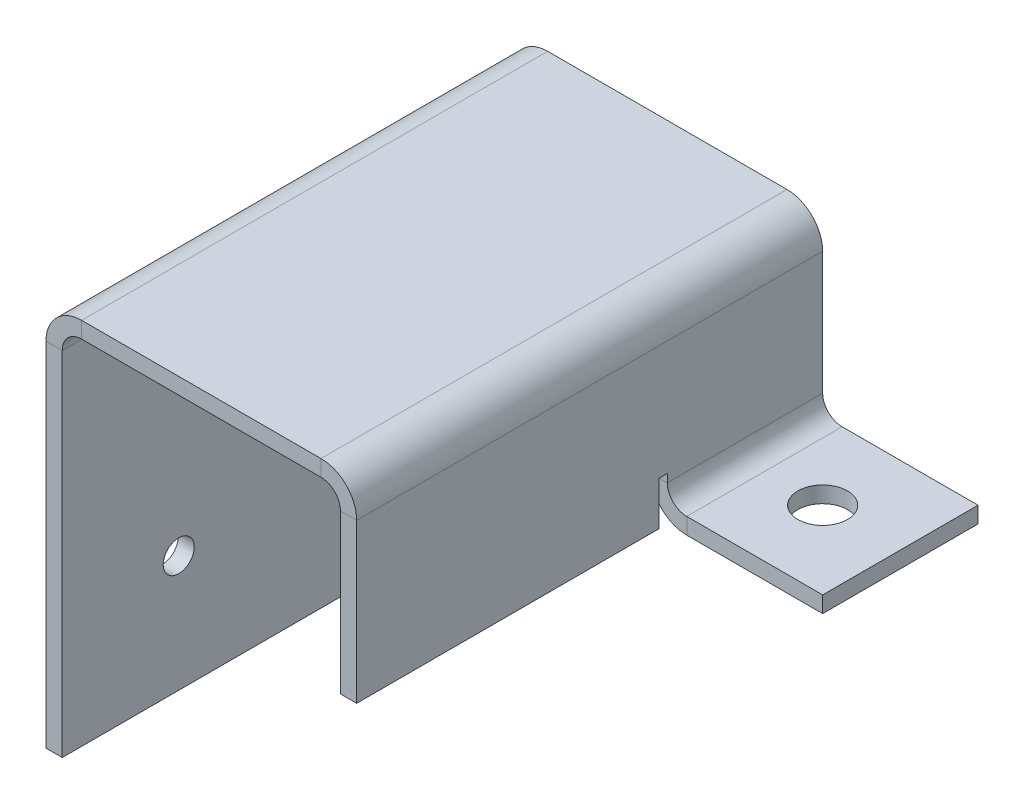
ISO-10303-21;
HEADER;
FILE_DESCRIPTION(('STEP AP214'),'2;1');
FILE_NAME('part.step','',(''),(''),'','','');
FILE_SCHEMA(('AUTOMOTIVE_DESIGN { 1 0 10303 214 1 1 1 1 }'));
ENDSEC;
DATA;
#1=APPLICATION_CONTEXT('core data for automotive mechanical design processes');
#2=APPLICATION_PROTOCOL_DEFINITION('international standard','automotive_design',2000,#1);
#3=PRODUCT_CONTEXT('',#1,'mechanical');
#4=PRODUCT('Part','Part','',(#3));
#5=PRODUCT_RELATED_PRODUCT_CATEGORY('part','',(#4));
#6=PRODUCT_DEFINITION_FORMATION('','',#4);
#7=PRODUCT_DEFINITION_CONTEXT('part definition',#1,'design');
#8=PRODUCT_DEFINITION('design','',#6,#7);
#9=PRODUCT_DEFINITION_SHAPE('','',#8);
#10=(LENGTH_UNIT() NAMED_UNIT(*) SI_UNIT(.MILLI.,.METRE.));
#11=(NAMED_UNIT(*) PLANE_ANGLE_UNIT() SI_UNIT($,.RADIAN.));
#12=(NAMED_UNIT(*) SI_UNIT($,.STERADIAN.) SOLID_ANGLE_UNIT());
#13=UNCERTAINTY_MEASURE_WITH_UNIT(LENGTH_MEASURE(1.E-05),#10,'distance_accuracy_value','');
#14=(GEOMETRIC_REPRESENTATION_CONTEXT(3) GLOBAL_UNCERTAINTY_ASSIGNED_CONTEXT((#13)) GLOBAL_UNIT_ASSIGNED_CONTEXT((#10,
#11,#12)) REPRESENTATION_CONTEXT('',''));
#15=CARTESIAN_POINT('',(0.,0.,0.));
#16=DIRECTION('',(0.,0.,1.));
#17=DIRECTION('',(1.,0.,0.));
#18=AXIS2_PLACEMENT_3D('',#15,#16,#17);
#19=CARTESIAN_POINT('',(48.14316,63.5,76.2));
#20=DIRECTION('',(1.,0.,0.));
#21=DIRECTION('',(0.,0.,-1.));
#22=AXIS2_PLACEMENT_3D('',#19,#20,#21);
#23=PLANE('',#22);
#24=DIRECTION('',(0.,0.,1.));
#25=VECTOR('',#24,1.);
#26=CARTESIAN_POINT('',(48.14316,37.5818399999907,-381.));
#27=LINE('',#26,#25);
#28=CARTESIAN_POINT('',(48.14316,37.5818399999907,0.));
#29=VERTEX_POINT('',#28);
#30=CARTESIAN_POINT('',(48.14316,37.5818399999907,25.4));
#31=VERTEX_POINT('',#30);
#32=EDGE_CURVE('E196',#29,#31,#27,.T.);
#33=ORIENTED_EDGE('',*,*,#32,.T.);
#34=DIRECTION('',(0.,1.,0.));
#35=VECTOR('',#34,1.);
#36=CARTESIAN_POINT('',(48.14316,31.75,25.4));
#37=LINE('',#36,#35);
#38=CARTESIAN_POINT('',(48.14316,38.9102599999907,25.4));
#39=VERTEX_POINT('',#38);
#40=EDGE_CURVE('E244',#31,#39,#37,.T.);
#41=ORIENTED_EDGE('',*,*,#40,.T.);
#42=DIRECTION('',(0.,0.,1.));
#43=VECTOR('',#42,1.);
#44=CARTESIAN_POINT('',(48.14316,38.9102599999907,25.4));
#45=LINE('',#44,#43);
#46=CARTESIAN_POINT('',(48.14316,38.9102599999907,26.72842));
#47=VERTEX_POINT('',#46);
#48=EDGE_CURVE('E248',#39,#47,#45,.T.);
#49=ORIENTED_EDGE('',*,*,#48,.T.);
#50=DIRECTION('',(0.,-1.,0.));
#51=VECTOR('',#50,1.);
#52=CARTESIAN_POINT('',(48.14316,38.9102599999907,26.72842));
#53=LINE('',#52,#51);
#54=CARTESIAN_POINT('',(48.14316,31.75,26.72842));
#55=VERTEX_POINT('',#54);
#56=EDGE_CURVE('E256',#47,#55,#53,.T.);
#57=ORIENTED_EDGE('',*,*,#56,.T.);
#58=DIRECTION('',(0.,0.,-1.));
#59=VECTOR('',#58,1.);
#60=CARTESIAN_POINT('',(48.14316,31.75,76.2));
#61=LINE('',#60,#59);
#62=CARTESIAN_POINT('',(48.14316,31.75,76.2));
#63=VERTEX_POINT('',#62);
#64=EDGE_CURVE('E386',#63,#55,#61,.T.);
#65=ORIENTED_EDGE('',*,*,#64,.F.);
#66=DIRECTION('',(0.,1.,0.));
#67=VECTOR('',#66,1.);
#68=CARTESIAN_POINT('',(48.14316,63.5,76.2));
#69=LINE('',#68,#67);
#70=CARTESIAN_POINT('',(48.14316,57.66816,76.2));
#71=VERTEX_POINT('',#70);
#72=EDGE_CURVE('E322',#71,#63,#69,.F.);
#73=ORIENTED_EDGE('',*,*,#72,.F.);
#74=DIRECTION('',(0.,0.,-1.));
#75=VECTOR('',#74,1.);
#76=CARTESIAN_POINT('',(48.14316,57.66816,76.2));
#77=LINE('',#76,#75);
#78=CARTESIAN_POINT('',(48.14316,57.66816,0.));
#79=VERTEX_POINT('',#78);
#80=EDGE_CURVE('E355',#71,#79,#77,.T.);
#81=ORIENTED_EDGE('',*,*,#80,.T.);
#82=DIRECTION('',(0.,1.,0.));
#83=VECTOR('',#82,1.);
#84=CARTESIAN_POINT('',(48.14316,63.5,0.));
#85=LINE('',#84,#83);
#86=EDGE_CURVE('E289',#79,#29,#85,.F.);
#87=ORIENTED_EDGE('',*,*,#86,.T.);
#88=EDGE_LOOP('',(#33,#41,#49,#57,#65,#73,#81,#87));
#89=FACE_BOUND('',#88,.T.);
#90=ADVANCED_FACE('F36',(#89),#23,.F.);
#91=CARTESIAN_POINT('',(50.8,63.5,76.2));
#92=DIRECTION('',(1.,0.,0.));
#93=DIRECTION('',(0.,0.,-1.));
#94=AXIS2_PLACEMENT_3D('',#91,#92,#93);
#95=PLANE('',#94);
#96=DIRECTION('',(0.,1.,0.));
#97=VECTOR('',#96,1.);
#98=CARTESIAN_POINT('',(50.8,31.75,25.4));
#99=LINE('',#98,#97);
#100=CARTESIAN_POINT('',(50.8,37.5818399999907,25.4));
#101=VERTEX_POINT('',#100);
#102=CARTESIAN_POINT('',(50.8,38.9102599999907,25.4));
#103=VERTEX_POINT('',#102);
#104=EDGE_CURVE('E232',#101,#103,#99,.T.);
#105=ORIENTED_EDGE('',*,*,#104,.F.);
#106=DIRECTION('',(0.,0.,1.));
#107=VECTOR('',#106,1.);
#108=CARTESIAN_POINT('',(50.8,37.5818399999906,-381.));
#109=LINE('',#108,#107);
#110=CARTESIAN_POINT('',(50.8,37.5818399999906,0.));
#111=VERTEX_POINT('',#110);
#112=EDGE_CURVE('E405',#111,#101,#109,.T.);
#113=ORIENTED_EDGE('',*,*,#112,.F.);
#114=DIRECTION('',(0.,-1.,0.));
#115=VECTOR('',#114,1.);
#116=CARTESIAN_POINT('',(50.8,63.5,0.));
#117=LINE('',#116,#115);
#118=CARTESIAN_POINT('',(50.8,57.66816,0.));
#119=VERTEX_POINT('',#118);
#120=EDGE_CURVE('E292',#119,#111,#117,.T.);
#121=ORIENTED_EDGE('',*,*,#120,.F.);
#122=DIRECTION('',(0.,0.,-1.));
#123=VECTOR('',#122,1.);
#124=CARTESIAN_POINT('',(50.8,57.66816,76.2));
#125=LINE('',#124,#123);
#126=CARTESIAN_POINT('',(50.8,57.66816,76.2));
#127=VERTEX_POINT('',#126);
#128=EDGE_CURVE('E380',#127,#119,#125,.T.);
#129=ORIENTED_EDGE('',*,*,#128,.F.);
#130=DIRECTION('',(0.,-1.,0.));
#131=VECTOR('',#130,1.);
#132=CARTESIAN_POINT('',(50.8,63.5,76.2));
#133=LINE('',#132,#131);
#134=CARTESIAN_POINT('',(50.8,31.75,76.2));
#135=VERTEX_POINT('',#134);
#136=EDGE_CURVE('E327',#127,#135,#133,.T.);
#137=ORIENTED_EDGE('',*,*,#136,.T.);
#138=DIRECTION('',(0.,0.,-1.));
#139=VECTOR('',#138,1.);
#140=CARTESIAN_POINT('',(50.8,31.75,76.2));
#141=LINE('',#140,#139);
#142=CARTESIAN_POINT('',(50.8,31.75,26.72842));
#143=VERTEX_POINT('',#142);
#144=EDGE_CURVE('E383',#135,#143,#141,.T.);
#145=ORIENTED_EDGE('',*,*,#144,.T.);
#146=DIRECTION('',(0.,-1.,0.));
#147=VECTOR('',#146,1.);
#148=CARTESIAN_POINT('',(50.8,38.9102599999907,26.72842));
#149=LINE('',#148,#147);
#150=CARTESIAN_POINT('',(50.8,38.9102599999907,26.72842));
#151=VERTEX_POINT('',#150);
#152=EDGE_CURVE('E249',#151,#143,#149,.T.);
#153=ORIENTED_EDGE('',*,*,#152,.F.);
#154=DIRECTION('',(0.,0.,1.));
#155=VECTOR('',#154,1.);
#156=CARTESIAN_POINT('',(50.8,38.9102599999907,25.4));
#157=LINE('',#156,#155);
#158=EDGE_CURVE('E237',#103,#151,#157,.T.);
#159=ORIENTED_EDGE('',*,*,#158,.F.);
#160=EDGE_LOOP('',(#105,#113,#121,#129,#137,#145,#153,#159));
#161=FACE_BOUND('',#160,.T.);
#162=ADVANCED_FACE('F436',(#161),#95,.T.);
#163=CARTESIAN_POINT('',(44.96816,57.66816,0.));
#164=DIRECTION('',(0.,0.,1.));
#165=DIRECTION('',(1.,0.,0.));
#166=AXIS2_PLACEMENT_3D('',#163,#164,#165);
#167=PLANE('',#166);
#168=DIRECTION('',(1.,0.,0.));
#169=VECTOR('',#168,1.);
#170=CARTESIAN_POINT('',(48.14316,37.5818399999907,0.));
#171=LINE('',#170,#169);
#172=EDGE_CURVE('E212',#29,#111,#171,.T.);
#173=ORIENTED_EDGE('',*,*,#172,.F.);
#174=ORIENTED_EDGE('',*,*,#86,.F.);
#175=DIRECTION('',(1.,0.,0.));
#176=VECTOR('',#175,1.);
#177=CARTESIAN_POINT('',(48.14316,57.66816,0.));
#178=LINE('',#177,#176);
#179=EDGE_CURVE('E389',#79,#119,#178,.T.);
#180=ORIENTED_EDGE('',*,*,#179,.T.);
#181=ORIENTED_EDGE('',*,*,#120,.T.);
#182=EDGE_LOOP('',(#173,#174,#180,#181));
#183=FACE_BOUND('',#182,.T.);
#184=ADVANCED_FACE('F512',(#183),#167,.F.);
#185=CARTESIAN_POINT('',(5.83184,63.5,76.2));
#186=DIRECTION('',(0.,0.,1.));
#187=DIRECTION('',(1.,0.,0.));
#188=AXIS2_PLACEMENT_3D('',#185,#186,#187);
#189=PLANE('',#188);
#190=DIRECTION('',(0.,-1.,0.));
#191=VECTOR('',#190,1.);
#192=CARTESIAN_POINT('',(5.83184,63.5,76.2));
#193=LINE('',#192,#191);
#194=CARTESIAN_POINT('',(5.83184,63.5,76.2));
#195=VERTEX_POINT('',#194);
#196=CARTESIAN_POINT('',(5.83183999999999,60.84316,76.2));
#197=VERTEX_POINT('',#196);
#198=EDGE_CURVE('E11',#195,#197,#193,.T.);
#199=ORIENTED_EDGE('',*,*,#198,.F.);
#200=CARTESIAN_POINT('',(5.83184,57.66816,76.2));
#201=DIRECTION('',(0.,0.,1.));
#202=DIRECTION('',(1.,0.,0.));
#203=AXIS2_PLACEMENT_3D('',#200,#201,#202);
#204=CIRCLE('',#203,5.83184);
#205=CARTESIAN_POINT('',(0.,57.66816,76.2));
#206=VERTEX_POINT('',#205);
#207=EDGE_CURVE('E336',#206,#195,#204,.F.);
#208=ORIENTED_EDGE('',*,*,#207,.F.);
#209=DIRECTION('',(-1.,0.,0.));
#210=VECTOR('',#209,1.);
#211=CARTESIAN_POINT('',(2.65684,57.66816,76.2));
#212=LINE('',#211,#210);
#213=CARTESIAN_POINT('',(2.65684,57.66816,76.2));
#214=VERTEX_POINT('',#213);
#215=EDGE_CURVE('E45',#214,#206,#212,.T.);
#216=ORIENTED_EDGE('',*,*,#215,.F.);
#217=CARTESIAN_POINT('',(5.83184,57.66816,76.2));
#218=DIRECTION('',(0.,0.,1.));
#219=DIRECTION('',(1.,0.,0.));
#220=AXIS2_PLACEMENT_3D('',#217,#218,#219);
#221=CIRCLE('',#220,3.175);
#222=EDGE_CURVE('E348',#214,#197,#221,.F.);
#223=ORIENTED_EDGE('',*,*,#222,.T.);
#224=EDGE_LOOP('',(#199,#208,#216,#223));
#225=FACE_BOUND('',#224,.T.);
#226=ADVANCED_FACE('F38',(#225),#189,.T.);
#227=CARTESIAN_POINT('',(2.65684,57.66816,76.2));
#228=DIRECTION('',(0.,0.,1.));
#229=DIRECTION('',(1.,0.,0.));
#230=AXIS2_PLACEMENT_3D('',#227,#228,#229);
#231=PLANE('',#230);
#232=DIRECTION('',(1.,0.,0.));
#233=VECTOR('',#232,1.);
#234=CARTESIAN_POINT('',(0.,63.5,76.2));
#235=LINE('',#234,#233);
#236=CARTESIAN_POINT('',(44.96816,63.5,76.2));
#237=VERTEX_POINT('',#236);
#238=EDGE_CURVE('E333',#195,#237,#235,.T.);
#239=ORIENTED_EDGE('',*,*,#238,.F.);
#240=ORIENTED_EDGE('',*,*,#198,.T.);
#241=DIRECTION('',(1.,0.,0.));
#242=VECTOR('',#241,1.);
#243=CARTESIAN_POINT('',(0.,60.84316,76.2));
#244=LINE('',#243,#242);
#245=CARTESIAN_POINT('',(44.96816,60.84316,76.2));
#246=VERTEX_POINT('',#245);
#247=EDGE_CURVE('E351',#197,#246,#244,.T.);
#248=ORIENTED_EDGE('',*,*,#247,.T.);
#249=DIRECTION('',(0.,1.,0.));
#250=VECTOR('',#249,1.);
#251=CARTESIAN_POINT('',(44.96816,60.84316,76.2));
#252=LINE('',#251,#250);
#253=EDGE_CURVE('E60',#246,#237,#252,.T.);
#254=ORIENTED_EDGE('',*,*,#253,.T.);
#255=EDGE_LOOP('',(#239,#240,#248,#254));
#256=FACE_BOUND('',#255,.T.);
#257=ADVANCED_FACE('F456',(#256),#231,.T.);
#258=CARTESIAN_POINT('',(0.,57.66816,0.));
#259=DIRECTION('',(0.,0.,-1.));
#260=DIRECTION('',(-1.,0.,0.));
#261=AXIS2_PLACEMENT_3D('',#258,#259,#260);
#262=PLANE('',#261);
#263=DIRECTION('',(1.,0.,0.));
#264=VECTOR('',#263,1.);
#265=CARTESIAN_POINT('',(0.,57.66816,0.));
#266=LINE('',#265,#264);
#267=CARTESIAN_POINT('',(0.,57.66816,0.));
#268=VERTEX_POINT('',#267);
#269=CARTESIAN_POINT('',(2.65684,57.66816,0.));
#270=VERTEX_POINT('',#269);
#271=EDGE_CURVE('E397',#268,#270,#266,.T.);
#272=ORIENTED_EDGE('',*,*,#271,.F.);
#273=CARTESIAN_POINT('',(5.83184,57.66816,0.));
#274=DIRECTION('',(0.,0.,1.));
#275=DIRECTION('',(1.,0.,0.));
#276=AXIS2_PLACEMENT_3D('',#273,#274,#275);
#277=CIRCLE('',#276,5.83184);
#278=CARTESIAN_POINT('',(5.83184,63.5,0.));
#279=VERTEX_POINT('',#278);
#280=EDGE_CURVE('E301',#268,#279,#277,.F.);
#281=ORIENTED_EDGE('',*,*,#280,.T.);
#282=DIRECTION('',(0.,1.,0.));
#283=VECTOR('',#282,1.);
#284=CARTESIAN_POINT('',(5.83183999999999,60.84316,0.));
#285=LINE('',#284,#283);
#286=CARTESIAN_POINT('',(5.83183999999999,60.84316,0.));
#287=VERTEX_POINT('',#286);
#288=EDGE_CURVE('E395',#287,#279,#285,.T.);
#289=ORIENTED_EDGE('',*,*,#288,.F.);
#290=CARTESIAN_POINT('',(5.83184,57.66816,0.));
#291=DIRECTION('',(0.,0.,1.));
#292=DIRECTION('',(1.,0.,0.));
#293=AXIS2_PLACEMENT_3D('',#290,#291,#292);
#294=CIRCLE('',#293,3.175);
#295=EDGE_CURVE('E313',#270,#287,#294,.F.);
#296=ORIENTED_EDGE('',*,*,#295,.F.);
#297=EDGE_LOOP('',(#272,#281,#289,#296));
#298=FACE_BOUND('',#297,.T.);
#299=ADVANCED_FACE('F531',(#298),#262,.T.);
#300=CARTESIAN_POINT('',(5.83183999999999,60.84316,0.));
#301=DIRECTION('',(0.,0.,-1.));
#302=DIRECTION('',(-1.,0.,0.));
#303=AXIS2_PLACEMENT_3D('',#300,#301,#302);
#304=PLANE('',#303);
#305=DIRECTION('',(0.,1.,0.));
#306=VECTOR('',#305,1.);
#307=CARTESIAN_POINT('',(0.,63.5,0.));
#308=LINE('',#307,#306);
#309=CARTESIAN_POINT('',(0.,0.,0.));
#310=VERTEX_POINT('',#309);
#311=EDGE_CURVE('E304',#310,#268,#308,.T.);
#312=ORIENTED_EDGE('',*,*,#311,.T.);
#313=ORIENTED_EDGE('',*,*,#271,.T.);
#314=DIRECTION('',(0.,1.,0.));
#315=VECTOR('',#314,1.);
#316=CARTESIAN_POINT('',(2.65684,63.5,0.));
#317=LINE('',#316,#315);
#318=CARTESIAN_POINT('',(2.65684,0.,0.));
#319=VERTEX_POINT('',#318);
#320=EDGE_CURVE('E310',#319,#270,#317,.T.);
#321=ORIENTED_EDGE('',*,*,#320,.F.);
#322=DIRECTION('',(-1.,0.,0.));
#323=VECTOR('',#322,1.);
#324=CARTESIAN_POINT('',(2.65684,0.,0.));
#325=LINE('',#324,#323);
#326=EDGE_CURVE('E307',#319,#310,#325,.T.);
#327=ORIENTED_EDGE('',*,*,#326,.T.);
#328=EDGE_LOOP('',(#312,#313,#321,#327));
#329=FACE_BOUND('',#328,.T.);
#330=ADVANCED_FACE('F528',(#329),#304,.T.);
#331=CARTESIAN_POINT('',(50.8,57.66816,76.2));
#332=DIRECTION('',(0.,0.,1.));
#333=DIRECTION('',(1.,0.,0.));
#334=AXIS2_PLACEMENT_3D('',#331,#332,#333);
#335=PLANE('',#334);
#336=DIRECTION('',(-1.,0.,0.));
#337=VECTOR('',#336,1.);
#338=CARTESIAN_POINT('',(50.8,57.66816,76.2));
#339=LINE('',#338,#337);
#340=EDGE_CURVE('E53',#127,#71,#339,.T.);
#341=ORIENTED_EDGE('',*,*,#340,.F.);
#342=CARTESIAN_POINT('',(44.96816,57.66816,76.2));
#343=DIRECTION('',(0.,0.,1.));
#344=DIRECTION('',(1.,0.,0.));
#345=AXIS2_PLACEMENT_3D('',#342,#343,#344);
#346=CIRCLE('',#345,5.83184);
#347=EDGE_CURVE('E330',#237,#127,#346,.F.);
#348=ORIENTED_EDGE('',*,*,#347,.F.);
#349=ORIENTED_EDGE('',*,*,#253,.F.);
#350=CARTESIAN_POINT('',(44.96816,57.66816,76.2));
#351=DIRECTION('',(0.,0.,1.));
#352=DIRECTION('',(1.,0.,0.));
#353=AXIS2_PLACEMENT_3D('',#350,#351,#352);
#354=CIRCLE('',#353,3.175);
#355=EDGE_CURVE('E353',#246,#71,#354,.F.);
#356=ORIENTED_EDGE('',*,*,#355,.T.);
#357=EDGE_LOOP('',(#341,#348,#349,#356));
#358=FACE_BOUND('',#357,.T.);
#359=ADVANCED_FACE('F449',(#358),#335,.T.);
#360=CARTESIAN_POINT('',(44.96816,60.84316,76.2));
#361=DIRECTION('',(0.,0.,1.));
#362=DIRECTION('',(1.,0.,0.));
#363=AXIS2_PLACEMENT_3D('',#360,#361,#362);
#364=PLANE('',#363);
#365=ORIENTED_EDGE('',*,*,#136,.F.);
#366=ORIENTED_EDGE('',*,*,#340,.T.);
#367=ORIENTED_EDGE('',*,*,#72,.T.);
#368=DIRECTION('',(-1.,0.,0.));
#369=VECTOR('',#368,1.);
#370=CARTESIAN_POINT('',(50.8,31.75,76.2));
#371=LINE('',#370,#369);
#372=EDGE_CURVE('E324',#135,#63,#371,.T.);
#373=ORIENTED_EDGE('',*,*,#372,.F.);
#374=EDGE_LOOP('',(#365,#366,#367,#373));
#375=FACE_BOUND('',#374,.T.);
#376=ADVANCED_FACE('F444',(#375),#364,.T.);
#377=CARTESIAN_POINT('',(44.96816,63.5,0.));
#378=DIRECTION('',(0.,0.,-1.));
#379=DIRECTION('',(-1.,0.,0.));
#380=AXIS2_PLACEMENT_3D('',#377,#378,#379);
#381=PLANE('',#380);
#382=DIRECTION('',(0.,-1.,0.));
#383=VECTOR('',#382,1.);
#384=CARTESIAN_POINT('',(44.96816,63.5,0.));
#385=LINE('',#384,#383);
#386=CARTESIAN_POINT('',(44.96816,63.5,0.));
#387=VERTEX_POINT('',#386);
#388=CARTESIAN_POINT('',(44.96816,60.84316,0.));
#389=VERTEX_POINT('',#388);
#390=EDGE_CURVE('E391',#387,#389,#385,.T.);
#391=ORIENTED_EDGE('',*,*,#390,.F.);
#392=CARTESIAN_POINT('',(44.96816,57.66816,0.));
#393=DIRECTION('',(0.,0.,1.));
#394=DIRECTION('',(1.,0.,0.));
#395=AXIS2_PLACEMENT_3D('',#392,#393,#394);
#396=CIRCLE('',#395,5.83184);
#397=EDGE_CURVE('E295',#387,#119,#396,.F.);
#398=ORIENTED_EDGE('',*,*,#397,.T.);
#399=ORIENTED_EDGE('',*,*,#179,.F.);
#400=CARTESIAN_POINT('',(44.96816,57.66816,0.));
#401=DIRECTION('',(0.,0.,1.));
#402=DIRECTION('',(1.,0.,0.));
#403=AXIS2_PLACEMENT_3D('',#400,#401,#402);
#404=CIRCLE('',#403,3.175);
#405=EDGE_CURVE('E319',#389,#79,#404,.F.);
#406=ORIENTED_EDGE('',*,*,#405,.F.);
#407=EDGE_LOOP('',(#391,#398,#399,#406));
#408=FACE_BOUND('',#407,.T.);
#409=ADVANCED_FACE('F519',(#408),#381,.T.);
#410=CARTESIAN_POINT('',(48.14316,57.66816,0.));
#411=DIRECTION('',(0.,0.,-1.));
#412=DIRECTION('',(-1.,0.,0.));
#413=AXIS2_PLACEMENT_3D('',#410,#411,#412);
#414=PLANE('',#413);
#415=DIRECTION('',(1.,0.,0.));
#416=VECTOR('',#415,1.);
#417=CARTESIAN_POINT('',(0.,63.5,0.));
#418=LINE('',#417,#416);
#419=EDGE_CURVE('E298',#279,#387,#418,.T.);
#420=ORIENTED_EDGE('',*,*,#419,.T.);
#421=ORIENTED_EDGE('',*,*,#390,.T.);
#422=DIRECTION('',(1.,0.,0.));
#423=VECTOR('',#422,1.);
#424=CARTESIAN_POINT('',(0.,60.84316,0.));
#425=LINE('',#424,#423);
#426=EDGE_CURVE('E316',#287,#389,#425,.T.);
#427=ORIENTED_EDGE('',*,*,#426,.F.);
#428=ORIENTED_EDGE('',*,*,#288,.T.);
#429=EDGE_LOOP('',(#420,#421,#427,#428));
#430=FACE_BOUND('',#429,.T.);
#431=ADVANCED_FACE('F516',(#430),#414,.T.);
#432=CARTESIAN_POINT('',(50.8,31.75,76.2));
#433=DIRECTION('',(0.,-1.,0.));
#434=DIRECTION('',(1.,0.,0.));
#435=AXIS2_PLACEMENT_3D('',#432,#433,#434);
#436=PLANE('',#435);
#437=DIRECTION('',(1.,0.,0.));
#438=VECTOR('',#437,1.);
#439=CARTESIAN_POINT('',(48.14316,31.75,26.72842));
#440=LINE('',#439,#438);
#441=EDGE_CURVE('E259',#55,#143,#440,.T.);
#442=ORIENTED_EDGE('',*,*,#441,.T.);
#443=ORIENTED_EDGE('',*,*,#144,.F.);
#444=ORIENTED_EDGE('',*,*,#372,.T.);
#445=ORIENTED_EDGE('',*,*,#64,.T.);
#446=EDGE_LOOP('',(#442,#443,#444,#445));
#447=FACE_BOUND('',#446,.T.);
#448=ADVANCED_FACE('F440',(#447),#436,.T.);
#449=CARTESIAN_POINT('',(44.96816,57.66816,76.2));
#450=DIRECTION('',(0.,0.,-1.));
#451=DIRECTION('',(-1.,0.,0.));
#452=AXIS2_PLACEMENT_3D('',#449,#450,#451);
#453=CYLINDRICAL_SURFACE('',#452,5.83184);
#454=ORIENTED_EDGE('',*,*,#397,.F.);
#455=DIRECTION('',(0.,0.,-1.));
#456=VECTOR('',#455,1.);
#457=CARTESIAN_POINT('',(44.96816,63.5,76.2));
#458=LINE('',#457,#456);
#459=EDGE_CURVE('E377',#237,#387,#458,.T.);
#460=ORIENTED_EDGE('',*,*,#459,.F.);
#461=ORIENTED_EDGE('',*,*,#347,.T.);
#462=ORIENTED_EDGE('',*,*,#128,.T.);
#463=EDGE_LOOP('',(#454,#460,#461,#462));
#464=FACE_BOUND('',#463,.T.);
#465=ADVANCED_FACE('F448',(#464),#453,.T.);
#466=CARTESIAN_POINT('',(0.,63.5,76.2));
#467=DIRECTION('',(0.,1.,0.));
#468=DIRECTION('',(0.,0.,1.));
#469=AXIS2_PLACEMENT_3D('',#466,#467,#468);
#470=PLANE('',#469);
#471=ORIENTED_EDGE('',*,*,#419,.F.);
#472=DIRECTION('',(0.,0.,-1.));
#473=VECTOR('',#472,1.);
#474=CARTESIAN_POINT('',(5.83184,63.5,76.2));
#475=LINE('',#474,#473);
#476=EDGE_CURVE('E374',#195,#279,#475,.T.);
#477=ORIENTED_EDGE('',*,*,#476,.F.);
#478=ORIENTED_EDGE('',*,*,#238,.T.);
#479=ORIENTED_EDGE('',*,*,#459,.T.);
#480=EDGE_LOOP('',(#471,#477,#478,#479));
#481=FACE_BOUND('',#480,.T.);
#482=ADVANCED_FACE('F454',(#481),#470,.T.);
#483=CARTESIAN_POINT('',(5.83184,57.66816,76.2));
#484=DIRECTION('',(0.,0.,-1.));
#485=DIRECTION('',(-1.,0.,0.));
#486=AXIS2_PLACEMENT_3D('',#483,#484,#485);
#487=CYLINDRICAL_SURFACE('',#486,5.83184);
#488=ORIENTED_EDGE('',*,*,#280,.F.);
#489=DIRECTION('',(0.,0.,-1.));
#490=VECTOR('',#489,1.);
#491=CARTESIAN_POINT('',(0.,57.66816,76.2));
#492=LINE('',#491,#490);
#493=EDGE_CURVE('E371',#206,#268,#492,.T.);
#494=ORIENTED_EDGE('',*,*,#493,.F.);
#495=ORIENTED_EDGE('',*,*,#207,.T.);
#496=ORIENTED_EDGE('',*,*,#476,.T.);
#497=EDGE_LOOP('',(#488,#494,#495,#496));
#498=FACE_BOUND('',#497,.T.);
#499=ADVANCED_FACE('F461',(#498),#487,.T.);
#500=CARTESIAN_POINT('',(0.,63.5,76.2));
#501=DIRECTION('',(-1.,0.,0.));
#502=DIRECTION('',(0.,-1.,0.));
#503=AXIS2_PLACEMENT_3D('',#500,#501,#502);
#504=PLANE('',#503);
#505=CARTESIAN_POINT('',(0.,19.05,19.05));
#506=DIRECTION('',(1.,0.,0.));
#507=DIRECTION('',(0.,1.,0.));
#508=AXIS2_PLACEMENT_3D('',#505,#506,#507);
#509=CIRCLE('',#508,2.54);
#510=CARTESIAN_POINT('',(0.,21.59,19.05));
#511=VERTEX_POINT('',#510);
#512=EDGE_CURVE('E270',#511,#511,#509,.T.);
#513=ORIENTED_EDGE('',*,*,#512,.T.);
#514=EDGE_LOOP('',(#513));
#515=FACE_BOUND('',#514,.T.);
#516=CARTESIAN_POINT('',(0.,44.45,38.1));
#517=DIRECTION('',(1.,0.,0.));
#518=DIRECTION('',(0.,1.,0.));
#519=AXIS2_PLACEMENT_3D('',#516,#517,#518);
#520=CIRCLE('',#519,2.54);
#521=CARTESIAN_POINT('',(0.,46.99,38.1));
#522=VERTEX_POINT('',#521);
#523=EDGE_CURVE('E278',#522,#522,#520,.T.);
#524=ORIENTED_EDGE('',*,*,#523,.T.);
#525=EDGE_LOOP('',(#524));
#526=FACE_BOUND('',#525,.T.);
#527=CARTESIAN_POINT('',(0.,19.05,57.15));
#528=DIRECTION('',(1.,0.,0.));
#529=DIRECTION('',(0.,1.,0.));
#530=AXIS2_PLACEMENT_3D('',#527,#528,#529);
#531=CIRCLE('',#530,2.54);
#532=CARTESIAN_POINT('',(0.,21.59,57.15));
#533=VERTEX_POINT('',#532);
#534=EDGE_CURVE('E286',#533,#533,#531,.T.);
#535=ORIENTED_EDGE('',*,*,#534,.T.);
#536=EDGE_LOOP('',(#535));
#537=FACE_BOUND('',#536,.T.);
#538=ORIENTED_EDGE('',*,*,#311,.F.);
#539=DIRECTION('',(0.,0.,-1.));
#540=VECTOR('',#539,1.);
#541=CARTESIAN_POINT('',(0.,0.,76.2));
#542=LINE('',#541,#540);
#543=CARTESIAN_POINT('',(0.,0.,76.2));
#544=VERTEX_POINT('',#543);
#545=EDGE_CURVE('E369',#544,#310,#542,.T.);
#546=ORIENTED_EDGE('',*,*,#545,.F.);
#547=DIRECTION('',(0.,1.,0.));
#548=VECTOR('',#547,1.);
#549=CARTESIAN_POINT('',(0.,63.5,76.2));
#550=LINE('',#549,#548);
#551=EDGE_CURVE('E339',#544,#206,#550,.T.);
#552=ORIENTED_EDGE('',*,*,#551,.T.);
#553=ORIENTED_EDGE('',*,*,#493,.T.);
#554=EDGE_LOOP('',(#538,#546,#552,#553));
#555=FACE_BOUND('',#554,.T.);
#556=ADVANCED_FACE('F466',(#515,#526,#537,#555),#504,.T.);
#557=CARTESIAN_POINT('',(2.65684,0.,76.2));
#558=DIRECTION('',(0.,-1.,0.));
#559=DIRECTION('',(0.,0.,-1.));
#560=AXIS2_PLACEMENT_3D('',#557,#558,#559);
#561=PLANE('',#560);
#562=ORIENTED_EDGE('',*,*,#326,.F.);
#563=DIRECTION('',(0.,0.,-1.));
#564=VECTOR('',#563,1.);
#565=CARTESIAN_POINT('',(2.65684,0.,76.2));
#566=LINE('',#565,#564);
#567=CARTESIAN_POINT('',(2.65684,0.,76.2));
#568=VERTEX_POINT('',#567);
#569=EDGE_CURVE('E367',#568,#319,#566,.T.);
#570=ORIENTED_EDGE('',*,*,#569,.F.);
#571=DIRECTION('',(-1.,0.,0.));
#572=VECTOR('',#571,1.);
#573=CARTESIAN_POINT('',(2.65684,0.,76.2));
#574=LINE('',#573,#572);
#575=EDGE_CURVE('E342',#568,#544,#574,.T.);
#576=ORIENTED_EDGE('',*,*,#575,.T.);
#577=ORIENTED_EDGE('',*,*,#545,.T.);
#578=EDGE_LOOP('',(#562,#570,#576,#577));
#579=FACE_BOUND('',#578,.T.);
#580=ADVANCED_FACE('F472',(#579),#561,.T.);
#581=CARTESIAN_POINT('',(2.65684,63.5,76.2));
#582=DIRECTION('',(-1.,0.,0.));
#583=DIRECTION('',(0.,-1.,0.));
#584=AXIS2_PLACEMENT_3D('',#581,#582,#583);
#585=PLANE('',#584);
#586=CARTESIAN_POINT('',(2.65684,19.05,19.05));
#587=DIRECTION('',(1.,0.,0.));
#588=DIRECTION('',(0.,1.,0.));
#589=AXIS2_PLACEMENT_3D('',#586,#587,#588);
#590=CIRCLE('',#589,2.54);
#591=CARTESIAN_POINT('',(2.65684,21.59,19.05));
#592=VERTEX_POINT('',#591);
#593=EDGE_CURVE('E250',#592,#592,#590,.T.);
#594=ORIENTED_EDGE('',*,*,#593,.F.);
#595=EDGE_LOOP('',(#594));
#596=FACE_BOUND('',#595,.T.);
#597=CARTESIAN_POINT('',(2.65684,44.45,38.1));
#598=DIRECTION('',(1.,0.,0.));
#599=DIRECTION('',(0.,1.,0.));
#600=AXIS2_PLACEMENT_3D('',#597,#598,#599);
#601=CIRCLE('',#600,2.54);
#602=CARTESIAN_POINT('',(2.65684,46.99,38.1));
#603=VERTEX_POINT('',#602);
#604=EDGE_CURVE('E274',#603,#603,#601,.T.);
#605=ORIENTED_EDGE('',*,*,#604,.F.);
#606=EDGE_LOOP('',(#605));
#607=FACE_BOUND('',#606,.T.);
#608=CARTESIAN_POINT('',(2.65684,19.05,57.15));
#609=DIRECTION('',(1.,0.,0.));
#610=DIRECTION('',(0.,1.,0.));
#611=AXIS2_PLACEMENT_3D('',#608,#609,#610);
#612=CIRCLE('',#611,2.54);
#613=CARTESIAN_POINT('',(2.65684,21.59,57.15));
#614=VERTEX_POINT('',#613);
#615=EDGE_CURVE('E283',#614,#614,#612,.T.);
#616=ORIENTED_EDGE('',*,*,#615,.F.);
#617=EDGE_LOOP('',(#616));
#618=FACE_BOUND('',#617,.T.);
#619=ORIENTED_EDGE('',*,*,#320,.T.);
#620=DIRECTION('',(0.,0.,-1.));
#621=VECTOR('',#620,1.);
#622=CARTESIAN_POINT('',(2.65684,57.66816,76.2));
#623=LINE('',#622,#621);
#624=EDGE_CURVE('E364',#214,#270,#623,.T.);
#625=ORIENTED_EDGE('',*,*,#624,.F.);
#626=DIRECTION('',(0.,1.,0.));
#627=VECTOR('',#626,1.);
#628=CARTESIAN_POINT('',(2.65684,63.5,76.2));
#629=LINE('',#628,#627);
#630=EDGE_CURVE('E345',#568,#214,#629,.T.);
#631=ORIENTED_EDGE('',*,*,#630,.F.);
#632=ORIENTED_EDGE('',*,*,#569,.T.);
#633=EDGE_LOOP('',(#619,#625,#631,#632));
#634=FACE_BOUND('',#633,.T.);
#635=ADVANCED_FACE('F477',(#596,#607,#618,#634),#585,.F.);
#636=CARTESIAN_POINT('',(5.83184,57.66816,76.2));
#637=DIRECTION('',(0.,0.,-1.));
#638=DIRECTION('',(-1.,0.,0.));
#639=AXIS2_PLACEMENT_3D('',#636,#637,#638);
#640=CYLINDRICAL_SURFACE('',#639,3.175);
#641=ORIENTED_EDGE('',*,*,#295,.T.);
#642=DIRECTION('',(0.,0.,-1.));
#643=VECTOR('',#642,1.);
#644=CARTESIAN_POINT('',(5.83183999999999,60.84316,76.2));
#645=LINE('',#644,#643);
#646=EDGE_CURVE('E361',#197,#287,#645,.T.);
#647=ORIENTED_EDGE('',*,*,#646,.F.);
#648=ORIENTED_EDGE('',*,*,#222,.F.);
#649=ORIENTED_EDGE('',*,*,#624,.T.);
#650=EDGE_LOOP('',(#641,#647,#648,#649));
#651=FACE_BOUND('',#650,.T.);
#652=ADVANCED_FACE('F482',(#651),#640,.F.);
#653=CARTESIAN_POINT('',(0.,60.84316,76.2));
#654=DIRECTION('',(0.,1.,0.));
#655=DIRECTION('',(0.,0.,1.));
#656=AXIS2_PLACEMENT_3D('',#653,#654,#655);
#657=PLANE('',#656);
#658=ORIENTED_EDGE('',*,*,#426,.T.);
#659=DIRECTION('',(0.,0.,-1.));
#660=VECTOR('',#659,1.);
#661=CARTESIAN_POINT('',(44.96816,60.84316,76.2));
#662=LINE('',#661,#660);
#663=EDGE_CURVE('E358',#246,#389,#662,.T.);
#664=ORIENTED_EDGE('',*,*,#663,.F.);
#665=ORIENTED_EDGE('',*,*,#247,.F.);
#666=ORIENTED_EDGE('',*,*,#646,.T.);
#667=EDGE_LOOP('',(#658,#664,#665,#666));
#668=FACE_BOUND('',#667,.T.);
#669=ADVANCED_FACE('F487',(#668),#657,.F.);
#670=CARTESIAN_POINT('',(44.96816,57.66816,76.2));
#671=DIRECTION('',(0.,0.,-1.));
#672=DIRECTION('',(-1.,0.,0.));
#673=AXIS2_PLACEMENT_3D('',#670,#671,#672);
#674=CYLINDRICAL_SURFACE('',#673,3.175);
#675=ORIENTED_EDGE('',*,*,#405,.T.);
#676=ORIENTED_EDGE('',*,*,#80,.F.);
#677=ORIENTED_EDGE('',*,*,#355,.F.);
#678=ORIENTED_EDGE('',*,*,#663,.T.);
#679=EDGE_LOOP('',(#675,#676,#677,#678));
#680=FACE_BOUND('',#679,.T.);
#681=ADVANCED_FACE('F492',(#680),#674,.F.);
#682=CARTESIAN_POINT('',(44.96816,57.66816,76.2));
#683=DIRECTION('',(0.,0.,1.));
#684=DIRECTION('',(1.,0.,0.));
#685=AXIS2_PLACEMENT_3D('',#682,#683,#684);
#686=PLANE('',#685);
#687=ORIENTED_EDGE('',*,*,#630,.T.);
#688=ORIENTED_EDGE('',*,*,#215,.T.);
#689=ORIENTED_EDGE('',*,*,#551,.F.);
#690=ORIENTED_EDGE('',*,*,#575,.F.);
#691=EDGE_LOOP('',(#687,#688,#689,#690));
#692=FACE_BOUND('',#691,.T.);
#693=ADVANCED_FACE('F469',(#692),#686,.T.);
#694=CARTESIAN_POINT('',(0.,19.05,57.15));
#695=DIRECTION('',(1.,0.,0.));
#696=DIRECTION('',(0.,1.,0.));
#697=AXIS2_PLACEMENT_3D('',#694,#695,#696);
#698=CYLINDRICAL_SURFACE('',#697,2.54);
#699=ORIENTED_EDGE('',*,*,#534,.F.);
#700=EDGE_LOOP('',(#699));
#701=FACE_BOUND('',#700,.T.);
#702=ORIENTED_EDGE('',*,*,#615,.T.);
#703=EDGE_LOOP('',(#702));
#704=FACE_BOUND('',#703,.T.);
#705=ADVANCED_FACE('F548',(#701,#704),#698,.F.);
#706=CARTESIAN_POINT('',(0.,44.45,38.1));
#707=DIRECTION('',(1.,0.,0.));
#708=DIRECTION('',(0.,1.,0.));
#709=AXIS2_PLACEMENT_3D('',#706,#707,#708);
#710=CYLINDRICAL_SURFACE('',#709,2.54);
#711=ORIENTED_EDGE('',*,*,#523,.F.);
#712=EDGE_LOOP('',(#711));
#713=FACE_BOUND('',#712,.T.);
#714=ORIENTED_EDGE('',*,*,#604,.T.);
#715=EDGE_LOOP('',(#714));
#716=FACE_BOUND('',#715,.T.);
#717=ADVANCED_FACE('F623',(#713,#716),#710,.F.);
#718=CARTESIAN_POINT('',(0.,19.05,19.05));
#719=DIRECTION('',(1.,0.,0.));
#720=DIRECTION('',(0.,1.,0.));
#721=AXIS2_PLACEMENT_3D('',#718,#719,#720);
#722=CYLINDRICAL_SURFACE('',#721,2.54);
#723=ORIENTED_EDGE('',*,*,#512,.F.);
#724=EDGE_LOOP('',(#723));
#725=FACE_BOUND('',#724,.T.);
#726=ORIENTED_EDGE('',*,*,#593,.T.);
#727=EDGE_LOOP('',(#726));
#728=FACE_BOUND('',#727,.T.);
#729=ADVANCED_FACE('F505',(#725,#728),#722,.F.);
#730=CARTESIAN_POINT('',(48.14316,31.75,25.4));
#731=DIRECTION('',(0.,0.,-1.));
#732=DIRECTION('',(-1.,0.,0.));
#733=AXIS2_PLACEMENT_3D('',#730,#731,#732);
#734=PLANE('',#733);
#735=DIRECTION('',(1.,0.,0.));
#736=VECTOR('',#735,1.);
#737=CARTESIAN_POINT('',(48.14316,37.5818399999907,25.4));
#738=LINE('',#737,#736);
#739=EDGE_CURVE('E402',#31,#101,#738,.T.);
#740=ORIENTED_EDGE('',*,*,#739,.T.);
#741=ORIENTED_EDGE('',*,*,#104,.T.);
#742=DIRECTION('',(1.,0.,0.));
#743=VECTOR('',#742,1.);
#744=CARTESIAN_POINT('',(48.14316,38.9102599999907,25.4));
#745=LINE('',#744,#743);
#746=EDGE_CURVE('E242',#39,#103,#745,.T.);
#747=ORIENTED_EDGE('',*,*,#746,.F.);
#748=ORIENTED_EDGE('',*,*,#40,.F.);
#749=EDGE_LOOP('',(#740,#741,#747,#748));
#750=FACE_BOUND('',#749,.T.);
#751=ADVANCED_FACE('F435',(#750),#734,.F.);
#752=CARTESIAN_POINT('',(48.14316,38.9102599999907,25.4));
#753=DIRECTION('',(0.,1.,0.));
#754=DIRECTION('',(0.,0.,1.));
#755=AXIS2_PLACEMENT_3D('',#752,#753,#754);
#756=PLANE('',#755);
#757=ORIENTED_EDGE('',*,*,#158,.T.);
#758=DIRECTION('',(1.,0.,0.));
#759=VECTOR('',#758,1.);
#760=CARTESIAN_POINT('',(48.14316,38.9102599999907,26.72842));
#761=LINE('',#760,#759);
#762=EDGE_CURVE('E261',#47,#151,#761,.T.);
#763=ORIENTED_EDGE('',*,*,#762,.F.);
#764=ORIENTED_EDGE('',*,*,#48,.F.);
#765=ORIENTED_EDGE('',*,*,#746,.T.);
#766=EDGE_LOOP('',(#757,#763,#764,#765));
#767=FACE_BOUND('',#766,.T.);
#768=ADVANCED_FACE('F496',(#767),#756,.F.);
#769=CARTESIAN_POINT('',(48.14316,38.9102599999907,26.72842));
#770=DIRECTION('',(0.,0.,1.));
#771=DIRECTION('',(1.,0.,0.));
#772=AXIS2_PLACEMENT_3D('',#769,#770,#771);
#773=PLANE('',#772);
#774=ORIENTED_EDGE('',*,*,#152,.T.);
#775=ORIENTED_EDGE('',*,*,#441,.F.);
#776=ORIENTED_EDGE('',*,*,#56,.F.);
#777=ORIENTED_EDGE('',*,*,#762,.T.);
#778=EDGE_LOOP('',(#774,#775,#776,#777));
#779=FACE_BOUND('',#778,.T.);
#780=ADVANCED_FACE('F438',(#779),#773,.F.);
#781=CARTESIAN_POINT('',(76.2,31.75,0.));
#782=DIRECTION('',(-1.,-4.21425763281179E-13,0.));
#783=DIRECTION('',(0.,0.,1.));
#784=AXIS2_PLACEMENT_3D('',#781,#782,#783);
#785=PLANE('',#784);
#786=DIRECTION('',(-4.21425763281179E-13,1.,0.));
#787=VECTOR('',#786,1.);
#788=CARTESIAN_POINT('',(76.2,31.75,25.4));
#789=LINE('',#788,#787);
#790=CARTESIAN_POINT('',(76.2,31.75,25.4));
#791=VERTEX_POINT('',#790);
#792=CARTESIAN_POINT('',(76.1999999999989,34.40684,25.4));
#793=VERTEX_POINT('',#792);
#794=EDGE_CURVE('E230',#791,#793,#789,.T.);
#795=ORIENTED_EDGE('',*,*,#794,.F.);
#796=DIRECTION('',(0.,0.,1.));
#797=VECTOR('',#796,1.);
#798=CARTESIAN_POINT('',(76.2,31.75,0.));
#799=LINE('',#798,#797);
#800=CARTESIAN_POINT('',(76.2,31.75,0.));
#801=VERTEX_POINT('',#800);
#802=EDGE_CURVE('E210',#801,#791,#799,.T.);
#803=ORIENTED_EDGE('',*,*,#802,.F.);
#804=DIRECTION('',(-4.21425763281179E-13,1.,0.));
#805=VECTOR('',#804,1.);
#806=CARTESIAN_POINT('',(76.2,31.75,0.));
#807=LINE('',#806,#805);
#808=CARTESIAN_POINT('',(76.1999999999989,34.40684,0.));
#809=VERTEX_POINT('',#808);
#810=EDGE_CURVE('E186',#801,#809,#807,.T.);
#811=ORIENTED_EDGE('',*,*,#810,.T.);
#812=DIRECTION('',(0.,0.,1.));
#813=VECTOR('',#812,1.);
#814=CARTESIAN_POINT('',(76.1999999999989,34.40684,0.));
#815=LINE('',#814,#813);
#816=EDGE_CURVE('E218',#809,#793,#815,.T.);
#817=ORIENTED_EDGE('',*,*,#816,.T.);
#818=EDGE_LOOP('',(#795,#803,#811,#817));
#819=FACE_BOUND('',#818,.T.);
#820=ADVANCED_FACE('F503',(#819),#785,.F.);
#821=CARTESIAN_POINT('',(76.2,31.75,0.));
#822=DIRECTION('',(0.,0.,-1.));
#823=DIRECTION('',(-1.,-4.21425763281179E-13,0.));
#824=AXIS2_PLACEMENT_3D('',#821,#822,#823);
#825=PLANE('',#824);
#826=ORIENTED_EDGE('',*,*,#810,.F.);
#827=DIRECTION('',(-1.,-4.21425763281179E-13,0.));
#828=VECTOR('',#827,1.);
#829=CARTESIAN_POINT('',(76.2,31.75,0.));
#830=LINE('',#829,#828);
#831=CARTESIAN_POINT('',(53.9750000000025,31.7499999999906,0.));
#832=VERTEX_POINT('',#831);
#833=EDGE_CURVE('E204',#801,#832,#830,.T.);
#834=ORIENTED_EDGE('',*,*,#833,.T.);
#835=DIRECTION('',(-4.21425763281179E-13,1.,0.));
#836=VECTOR('',#835,1.);
#837=CARTESIAN_POINT('',(53.9750000000025,31.7499999999906,0.));
#838=LINE('',#837,#836);
#839=CARTESIAN_POINT('',(53.9750000000014,34.4068399999906,0.));
#840=VERTEX_POINT('',#839);
#841=EDGE_CURVE('E175',#832,#840,#838,.T.);
#842=ORIENTED_EDGE('',*,*,#841,.T.);
#843=DIRECTION('',(-1.,-4.21425763281179E-13,0.));
#844=VECTOR('',#843,1.);
#845=CARTESIAN_POINT('',(76.1999999999989,34.40684,0.));
#846=LINE('',#845,#844);
#847=EDGE_CURVE('E223',#809,#840,#846,.T.);
#848=ORIENTED_EDGE('',*,*,#847,.F.);
#849=EDGE_LOOP('',(#826,#834,#842,#848));
#850=FACE_BOUND('',#849,.T.);
#851=ADVANCED_FACE('F209',(#850),#825,.T.);
#852=CARTESIAN_POINT('',(76.2,31.75,25.4));
#853=DIRECTION('',(0.,0.,1.));
#854=DIRECTION('',(1.,4.21425763281179E-13,0.));
#855=AXIS2_PLACEMENT_3D('',#852,#853,#854);
#856=PLANE('',#855);
#857=DIRECTION('',(1.,4.21425763281179E-13,0.));
#858=VECTOR('',#857,1.);
#859=CARTESIAN_POINT('',(76.2,31.75,25.4));
#860=LINE('',#859,#858);
#861=CARTESIAN_POINT('',(53.9750000000025,31.7499999999906,25.4));
#862=VERTEX_POINT('',#861);
#863=EDGE_CURVE('E207',#862,#791,#860,.T.);
#864=ORIENTED_EDGE('',*,*,#863,.T.);
#865=ORIENTED_EDGE('',*,*,#794,.T.);
#866=DIRECTION('',(-1.,-4.21425763281179E-13,0.));
#867=VECTOR('',#866,1.);
#868=CARTESIAN_POINT('',(76.1999999999989,34.40684,25.4));
#869=LINE('',#868,#867);
#870=CARTESIAN_POINT('',(53.9750000000014,34.4068399999906,25.4));
#871=VERTEX_POINT('',#870);
#872=EDGE_CURVE('E222',#871,#793,#869,.F.);
#873=ORIENTED_EDGE('',*,*,#872,.F.);
#874=DIRECTION('',(-4.21425763281179E-13,1.,0.));
#875=VECTOR('',#874,1.);
#876=CARTESIAN_POINT('',(53.9750000000025,31.7499999999906,25.4));
#877=LINE('',#876,#875);
#878=EDGE_CURVE('E187',#862,#871,#877,.T.);
#879=ORIENTED_EDGE('',*,*,#878,.F.);
#880=EDGE_LOOP('',(#864,#865,#873,#879));
#881=FACE_BOUND('',#880,.T.);
#882=ADVANCED_FACE('F424',(#881),#856,.T.);
#883=CARTESIAN_POINT('',(76.1999999999989,34.40684,0.));
#884=DIRECTION('',(-4.21425763281179E-13,1.,0.));
#885=DIRECTION('',(-1.,-4.21425763281179E-13,0.));
#886=AXIS2_PLACEMENT_3D('',#883,#884,#885);
#887=PLANE('',#886);
#888=CARTESIAN_POINT('',(63.5000000000048,34.4068399999972,12.7));
#889=DIRECTION('',(-4.6089791893108E-13,1.,0.));
#890=DIRECTION('',(-1.,-4.6089791893108E-13,0.));
#891=AXIS2_PLACEMENT_3D('',#888,#889,#890);
#892=CIRCLE('',#891,4.05694378299333);
#893=CARTESIAN_POINT('',(59.4430562170115,34.4068399999953,12.7));
#894=VERTEX_POINT('',#893);
#895=EDGE_CURVE('E900',#894,#894,#892,.T.);
#896=ORIENTED_EDGE('',*,*,#895,.F.);
#897=EDGE_LOOP('',(#896));
#898=FACE_BOUND('',#897,.T.);
#899=DIRECTION('',(0.,0.,1.));
#900=VECTOR('',#899,1.);
#901=CARTESIAN_POINT('',(53.9750000000014,34.4068399999906,0.));
#902=LINE('',#901,#900);
#903=EDGE_CURVE('E219',#840,#871,#902,.T.);
#904=ORIENTED_EDGE('',*,*,#903,.T.);
#905=ORIENTED_EDGE('',*,*,#872,.T.);
#906=ORIENTED_EDGE('',*,*,#816,.F.);
#907=ORIENTED_EDGE('',*,*,#847,.T.);
#908=EDGE_LOOP('',(#904,#905,#906,#907));
#909=FACE_BOUND('',#908,.T.);
#910=ADVANCED_FACE('F427',(#898,#909),#887,.T.);
#911=CARTESIAN_POINT('',(76.2,31.75,0.));
#912=DIRECTION('',(-4.21425763281179E-13,1.,0.));
#913=DIRECTION('',(-1.,-4.21425763281179E-13,0.));
#914=AXIS2_PLACEMENT_3D('',#911,#912,#913);
#915=PLANE('',#914);
#916=CARTESIAN_POINT('',(63.500000000006,31.7499999999946,12.7));
#917=DIRECTION('',(-4.21425763281179E-13,1.,0.));
#918=DIRECTION('',(-1.,-4.21425763281179E-13,0.));
#919=AXIS2_PLACEMENT_3D('',#916,#917,#918);
#920=CIRCLE('',#919,4.05694378299333);
#921=CARTESIAN_POINT('',(59.4430562170127,31.7499999999929,12.7));
#922=VERTEX_POINT('',#921);
#923=EDGE_CURVE('E40',#922,#922,#920,.T.);
#924=ORIENTED_EDGE('',*,*,#923,.T.);
#925=EDGE_LOOP('',(#924));
#926=FACE_BOUND('',#925,.T.);
#927=DIRECTION('',(0.,0.,1.));
#928=VECTOR('',#927,1.);
#929=CARTESIAN_POINT('',(53.9750000000025,31.7499999999906,0.));
#930=LINE('',#929,#928);
#931=EDGE_CURVE('E193',#832,#862,#930,.T.);
#932=ORIENTED_EDGE('',*,*,#931,.F.);
#933=ORIENTED_EDGE('',*,*,#833,.F.);
#934=ORIENTED_EDGE('',*,*,#802,.T.);
#935=ORIENTED_EDGE('',*,*,#863,.F.);
#936=EDGE_LOOP('',(#932,#933,#934,#935));
#937=FACE_BOUND('',#936,.T.);
#938=ADVANCED_FACE('F202',(#926,#937),#915,.F.);
#939=CARTESIAN_POINT('',(53.975,37.5818399999906,0.));
#940=DIRECTION('',(0.,0.,1.));
#941=DIRECTION('',(1.,0.,0.));
#942=AXIS2_PLACEMENT_3D('',#939,#940,#941);
#943=PLANE('',#942);
#944=ORIENTED_EDGE('',*,*,#841,.F.);
#945=CARTESIAN_POINT('',(53.975,37.5818399999906,0.));
#946=DIRECTION('',(0.,0.,-1.));
#947=DIRECTION('',(-1.,0.,0.));
#948=AXIS2_PLACEMENT_3D('',#945,#946,#947);
#949=CIRCLE('',#948,5.83184);
#950=EDGE_CURVE('E178',#832,#29,#949,.T.);
#951=ORIENTED_EDGE('',*,*,#950,.T.);
#952=ORIENTED_EDGE('',*,*,#172,.T.);
#953=CARTESIAN_POINT('',(53.975,37.5818399999906,0.));
#954=DIRECTION('',(0.,0.,1.));
#955=DIRECTION('',(1.,0.,0.));
#956=AXIS2_PLACEMENT_3D('',#953,#954,#955);
#957=CIRCLE('',#956,3.175);
#958=EDGE_CURVE('E181',#840,#111,#957,.F.);
#959=ORIENTED_EDGE('',*,*,#958,.F.);
#960=EDGE_LOOP('',(#944,#951,#952,#959));
#961=FACE_BOUND('',#960,.T.);
#962=ADVANCED_FACE('F177',(#961),#943,.F.);
#963=CARTESIAN_POINT('',(53.975,37.5818399999906,25.4));
#964=DIRECTION('',(0.,0.,-1.));
#965=DIRECTION('',(-1.,0.,0.));
#966=AXIS2_PLACEMENT_3D('',#963,#964,#965);
#967=PLANE('',#966);
#968=CARTESIAN_POINT('',(53.975,37.5818399999906,25.4));
#969=DIRECTION('',(0.,0.,1.));
#970=DIRECTION('',(1.,0.,0.));
#971=AXIS2_PLACEMENT_3D('',#968,#969,#970);
#972=CIRCLE('',#971,5.83184);
#973=EDGE_CURVE('E197',#31,#862,#972,.T.);
#974=ORIENTED_EDGE('',*,*,#973,.T.);
#975=ORIENTED_EDGE('',*,*,#878,.T.);
#976=CARTESIAN_POINT('',(53.975,37.5818399999906,25.4));
#977=DIRECTION('',(0.,0.,1.));
#978=DIRECTION('',(1.,0.,0.));
#979=AXIS2_PLACEMENT_3D('',#976,#977,#978);
#980=CIRCLE('',#979,3.175);
#981=EDGE_CURVE('E400',#101,#871,#980,.T.);
#982=ORIENTED_EDGE('',*,*,#981,.F.);
#983=ORIENTED_EDGE('',*,*,#739,.F.);
#984=EDGE_LOOP('',(#974,#975,#982,#983));
#985=FACE_BOUND('',#984,.T.);
#986=ADVANCED_FACE('F420',(#985),#967,.F.);
#987=CARTESIAN_POINT('',(53.975,37.5818399999906,-381.));
#988=DIRECTION('',(0.,0.,1.));
#989=DIRECTION('',(1.,0.,0.));
#990=AXIS2_PLACEMENT_3D('',#987,#988,#989);
#991=CYLINDRICAL_SURFACE('',#990,3.175);
#992=ORIENTED_EDGE('',*,*,#112,.T.);
#993=ORIENTED_EDGE('',*,*,#981,.T.);
#994=ORIENTED_EDGE('',*,*,#903,.F.);
#995=ORIENTED_EDGE('',*,*,#958,.T.);
#996=EDGE_LOOP('',(#992,#993,#994,#995));
#997=FACE_BOUND('',#996,.T.);
#998=ADVANCED_FACE('F429',(#997),#991,.F.);
#999=CARTESIAN_POINT('',(53.975,37.5818399999906,-381.));
#1000=DIRECTION('',(0.,0.,1.));
#1001=DIRECTION('',(1.,0.,0.));
#1002=AXIS2_PLACEMENT_3D('',#999,#1000,#1001);
#1003=CYLINDRICAL_SURFACE('',#1002,5.83184);
#1004=ORIENTED_EDGE('',*,*,#32,.F.);
#1005=ORIENTED_EDGE('',*,*,#950,.F.);
#1006=ORIENTED_EDGE('',*,*,#931,.T.);
#1007=ORIENTED_EDGE('',*,*,#973,.F.);
#1008=EDGE_LOOP('',(#1004,#1005,#1006,#1007));
#1009=FACE_BOUND('',#1008,.T.);
#1010=ADVANCED_FACE('F191',(#1009),#1003,.T.);
#1011=CARTESIAN_POINT('',(63.5000000000206,-5.8564264548977E-12,12.7));
#1012=DIRECTION('',(-4.6089791893108E-13,1.,0.));
#1013=DIRECTION('',(-1.,-4.6089791893108E-13,0.));
#1014=AXIS2_PLACEMENT_3D('',#1011,#1012,#1013);
#1015=CYLINDRICAL_SURFACE('',#1014,4.05694378299333);
#1016=ORIENTED_EDGE('',*,*,#895,.T.);
#1017=EDGE_LOOP('',(#1016));
#1018=FACE_BOUND('',#1017,.T.);
#1019=ORIENTED_EDGE('',*,*,#923,.F.);
#1020=EDGE_LOOP('',(#1019));
#1021=FACE_BOUND('',#1020,.T.);
#1022=ADVANCED_FACE('F752',(#1018,#1021),#1015,.F.);
#1023=CLOSED_SHELL('',(#90,#162,#184,#226,#257,#299,#330,#359,#376,#409,#431,#448,#465,#482,
#499,#556,#580,#635,#652,#669,#681,#693,#705,#717,#729,#751,#768,#780,#820,#851,#882,#910,#938,
#962,#986,#998,#1010,#1022));
#1024=MANIFOLD_SOLID_BREP('B2',#1023);
#1025=ADVANCED_BREP_SHAPE_REPRESENTATION('',(#18,#1024),#14);
#1026=SHAPE_DEFINITION_REPRESENTATION(#9,#1025);
ENDSEC;
END-ISO-10303-21;
